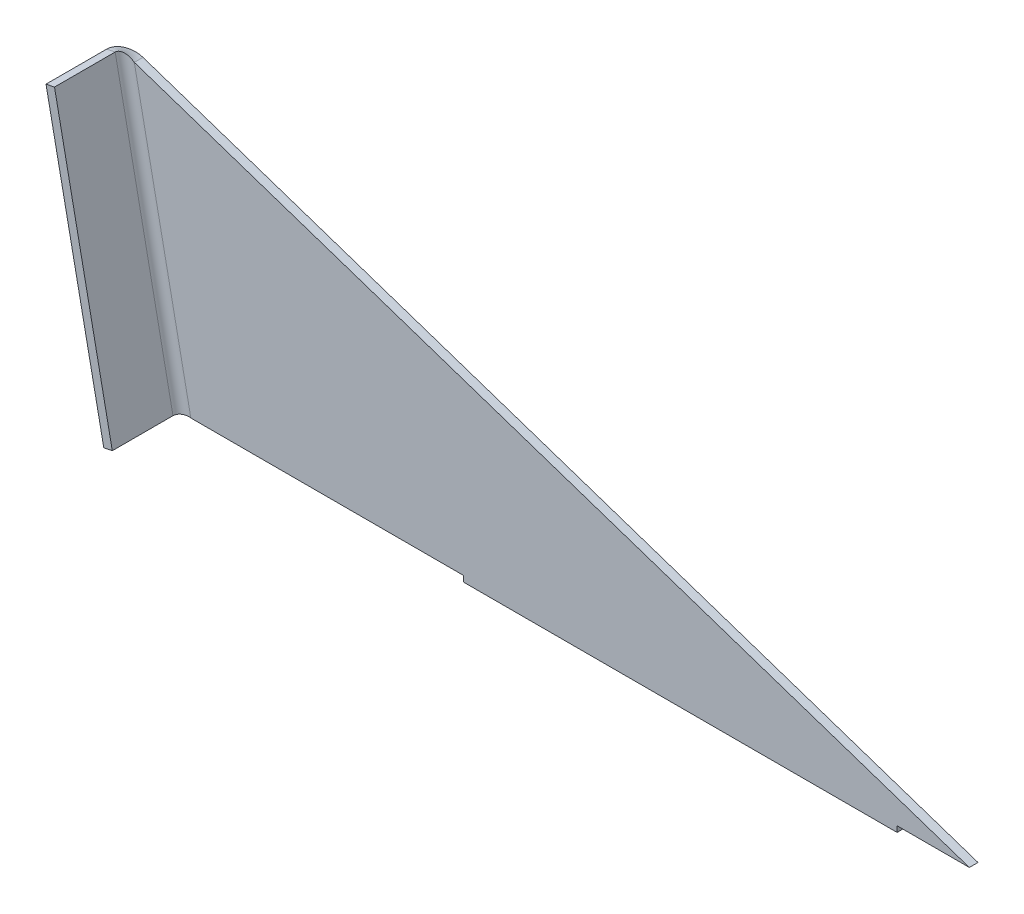
ISO-10303-21;
HEADER;
FILE_DESCRIPTION(('STEP AP214'),'2;1');
FILE_NAME('part.step','',(''),(''),'','','');
FILE_SCHEMA(('AUTOMOTIVE_DESIGN { 1 0 10303 214 1 1 1 1 }'));
ENDSEC;
DATA;
#1=APPLICATION_CONTEXT('core data for automotive mechanical design processes');
#2=APPLICATION_PROTOCOL_DEFINITION('international standard','automotive_design',2000,#1);
#3=PRODUCT_CONTEXT('',#1,'mechanical');
#4=PRODUCT('Part','Part','',(#3));
#5=PRODUCT_RELATED_PRODUCT_CATEGORY('part','',(#4));
#6=PRODUCT_DEFINITION_FORMATION('','',#4);
#7=PRODUCT_DEFINITION_CONTEXT('part definition',#1,'design');
#8=PRODUCT_DEFINITION('design','',#6,#7);
#9=PRODUCT_DEFINITION_SHAPE('','',#8);
#10=(LENGTH_UNIT() NAMED_UNIT(*) SI_UNIT(.MILLI.,.METRE.));
#11=(NAMED_UNIT(*) PLANE_ANGLE_UNIT() SI_UNIT($,.RADIAN.));
#12=(NAMED_UNIT(*) SI_UNIT($,.STERADIAN.) SOLID_ANGLE_UNIT());
#13=UNCERTAINTY_MEASURE_WITH_UNIT(LENGTH_MEASURE(1.E-05),#10,'distance_accuracy_value','');
#14=(GEOMETRIC_REPRESENTATION_CONTEXT(3) GLOBAL_UNCERTAINTY_ASSIGNED_CONTEXT((#13)) GLOBAL_UNIT_ASSIGNED_CONTEXT((#10,
#11,#12)) REPRESENTATION_CONTEXT('',''));
#15=CARTESIAN_POINT('',(0.,0.,0.));
#16=DIRECTION('',(0.,0.,1.));
#17=DIRECTION('',(1.,0.,0.));
#18=AXIS2_PLACEMENT_3D('',#15,#16,#17);
#19=CARTESIAN_POINT('',(20.,0.,2.));
#20=DIRECTION('',(0.198019801980198,-0.98019801980198,0.));
#21=DIRECTION('',(0.,0.,-1.));
#22=AXIS2_PLACEMENT_3D('',#19,#20,#21);
#23=PLANE('',#22);
#24=DIRECTION('',(-0.98019801980198,-0.198019801980198,0.));
#25=VECTOR('',#24,1.);
#26=CARTESIAN_POINT('',(20.,0.,6.));
#27=LINE('',#26,#25);
#28=CARTESIAN_POINT('',(22.940594059406,0.59405940594054,6.));
#29=VERTEX_POINT('',#28);
#30=CARTESIAN_POINT('',(20.,0.,6.));
#31=VERTEX_POINT('',#30);
#32=EDGE_CURVE('E11',#29,#31,#27,.T.);
#33=ORIENTED_EDGE('',*,*,#32,.F.);
#34=DIRECTION('',(0.,0.,1.));
#35=VECTOR('',#34,1.);
#36=CARTESIAN_POINT('',(22.940594059406,0.594059405940539,2.));
#37=LINE('',#36,#35);
#38=CARTESIAN_POINT('',(22.940594059406,0.594059405940539,27.));
#39=VERTEX_POINT('',#38);
#40=EDGE_CURVE('E96',#39,#29,#37,.F.);
#41=ORIENTED_EDGE('',*,*,#40,.F.);
#42=DIRECTION('',(-0.98019801980198,-0.198019801980198,0.));
#43=VECTOR('',#42,1.);
#44=CARTESIAN_POINT('',(20.,0.,27.));
#45=LINE('',#44,#43);
#46=CARTESIAN_POINT('',(20.,0.,27.));
#47=VERTEX_POINT('',#46);
#48=EDGE_CURVE('E47',#39,#47,#45,.T.);
#49=ORIENTED_EDGE('',*,*,#48,.T.);
#50=DIRECTION('',(0.,0.,-1.));
#51=VECTOR('',#50,1.);
#52=CARTESIAN_POINT('',(20.,0.,2.));
#53=LINE('',#52,#51);
#54=EDGE_CURVE('E99',#47,#31,#53,.T.);
#55=ORIENTED_EDGE('',*,*,#54,.T.);
#56=EDGE_LOOP('',(#33,#41,#49,#55));
#57=FACE_BOUND('',#56,.T.);
#58=ADVANCED_FACE('F35',(#57),#23,.T.);
#59=CARTESIAN_POINT('',(20.,0.,27.));
#60=DIRECTION('',(0.,0.,1.));
#61=DIRECTION('',(0.198019801980198,-0.98019801980198,0.));
#62=AXIS2_PLACEMENT_3D('',#59,#60,#61);
#63=PLANE('',#62);
#64=ORIENTED_EDGE('',*,*,#48,.F.);
#65=DIRECTION('',(-0.198019801980198,0.98019801980198,0.));
#66=VECTOR('',#65,1.);
#67=CARTESIAN_POINT('',(2.94059405940594,99.5940594059406,27.));
#68=LINE('',#67,#66);
#69=CARTESIAN_POINT('',(2.94059405940594,99.5940594059406,27.));
#70=VERTEX_POINT('',#69);
#71=EDGE_CURVE('E124',#70,#39,#68,.F.);
#72=ORIENTED_EDGE('',*,*,#71,.F.);
#73=DIRECTION('',(-0.98019801980198,-0.198019801980198,0.));
#74=VECTOR('',#73,1.);
#75=CARTESIAN_POINT('',(0.,99.,27.));
#76=LINE('',#75,#74);
#77=CARTESIAN_POINT('',(0.,99.,27.));
#78=VERTEX_POINT('',#77);
#79=EDGE_CURVE('E151',#70,#78,#76,.T.);
#80=ORIENTED_EDGE('',*,*,#79,.T.);
#81=DIRECTION('',(0.198019801980198,-0.98019801980198,0.));
#82=VECTOR('',#81,1.);
#83=CARTESIAN_POINT('',(20.,0.,27.));
#84=LINE('',#83,#82);
#85=EDGE_CURVE('E162',#78,#47,#84,.T.);
#86=ORIENTED_EDGE('',*,*,#85,.T.);
#87=EDGE_LOOP('',(#64,#72,#80,#86));
#88=FACE_BOUND('',#87,.T.);
#89=ADVANCED_FACE('F168',(#88),#63,.T.);
#90=CARTESIAN_POINT('',(0.,99.,2.));
#91=DIRECTION('',(0.198019801980198,-0.98019801980198,0.));
#92=DIRECTION('',(0.,0.,-1.));
#93=AXIS2_PLACEMENT_3D('',#90,#91,#92);
#94=PLANE('',#93);
#95=ORIENTED_EDGE('',*,*,#79,.F.);
#96=DIRECTION('',(0.,0.,1.));
#97=VECTOR('',#96,1.);
#98=CARTESIAN_POINT('',(2.94059405940594,99.5940594059406,2.));
#99=LINE('',#98,#97);
#100=CARTESIAN_POINT('',(2.94059405940594,99.5940594059406,6.));
#101=VERTEX_POINT('',#100);
#102=EDGE_CURVE('E214',#70,#101,#99,.F.);
#103=ORIENTED_EDGE('',*,*,#102,.T.);
#104=DIRECTION('',(-0.98019801980198,-0.198019801980198,0.));
#105=VECTOR('',#104,1.);
#106=CARTESIAN_POINT('',(0.,99.,6.));
#107=LINE('',#106,#105);
#108=CARTESIAN_POINT('',(0.,99.,6.));
#109=VERTEX_POINT('',#108);
#110=EDGE_CURVE('E148',#101,#109,#107,.T.);
#111=ORIENTED_EDGE('',*,*,#110,.T.);
#112=DIRECTION('',(0.,0.,-1.));
#113=VECTOR('',#112,1.);
#114=CARTESIAN_POINT('',(0.,99.,2.));
#115=LINE('',#114,#113);
#116=EDGE_CURVE('E169',#78,#109,#115,.T.);
#117=ORIENTED_EDGE('',*,*,#116,.F.);
#118=EDGE_LOOP('',(#95,#103,#111,#117));
#119=FACE_BOUND('',#118,.T.);
#120=ADVANCED_FACE('F218',(#119),#94,.F.);
#121=CARTESIAN_POINT('',(10.1905121939231,94.0069646400805,6.));
#122=CARTESIAN_POINT('',(11.1707102137251,94.2049844420607,6.));
#123=CARTESIAN_POINT('',(12.1509082335271,94.4030042440409,6.));
#124=CARTESIAN_POINT('',(13.1311062533291,94.6010240460211,6.));
#125=CARTESIAN_POINT('',(10.1905121939231,94.0069646400805,12.));
#126=CARTESIAN_POINT('',(11.1707102137251,94.2049844420607,14.));
#127=CARTESIAN_POINT('',(12.1509082335271,94.4030042440409,16.));
#128=CARTESIAN_POINT('',(13.1311062533291,94.6010240460211,18.));
#129=CARTESIAN_POINT('',(2.94059405940594,99.5940594059406,12.));
#130=CARTESIAN_POINT('',(1.96039603960396,99.3960396039604,14.));
#131=CARTESIAN_POINT('',(0.98019801980198,99.1980198019802,16.));
#132=CARTESIAN_POINT('',(0.,99.,18.));
#133=CARTESIAN_POINT('',(2.94059405940594,99.5940594059406,6.));
#134=CARTESIAN_POINT('',(1.96039603960396,99.3960396039604,6.));
#135=CARTESIAN_POINT('',(0.980198019801979,99.1980198019802,6.));
#136=CARTESIAN_POINT('',(0.,99.,6.));
#137=CARTESIAN_POINT('',(2.94059405940594,99.5940594059406,0.));
#138=CARTESIAN_POINT('',(1.96039603960396,99.3960396039604,-2.));
#139=CARTESIAN_POINT('',(0.980198019801978,99.1980198019802,-4.));
#140=CARTESIAN_POINT('',(0.,99.,-6.));
#141=CARTESIAN_POINT('',(10.1905121939231,94.0069646400805,0.));
#142=CARTESIAN_POINT('',(11.1707102137251,94.2049844420607,-2.));
#143=CARTESIAN_POINT('',(12.1509082335271,94.4030042440409,-4.));
#144=CARTESIAN_POINT('',(13.1311062533291,94.6010240460211,-6.));
#145=CARTESIAN_POINT('',(10.1905121939231,94.0069646400805,6.));
#146=CARTESIAN_POINT('',(11.1707102137251,94.2049844420607,6.));
#147=CARTESIAN_POINT('',(12.1509082335271,94.4030042440409,6.));
#148=CARTESIAN_POINT('',(13.1311062533291,94.6010240460211,6.));
#149=(BOUNDED_SURFACE() B_SPLINE_SURFACE(3,3,((#121,#122,#123,#124),(#125,#126,#127,#128),(#129,
#130,#131,#132),(#133,#134,#135,#136),(#137,#138,#139,#140),(#141,#142,#143,#144),(#145,#146,
#147,#148)),.UNSPECIFIED.,.T.,.F.,.F.) B_SPLINE_SURFACE_WITH_KNOTS((4,3,4),(4,4),(0.,0.5,1.),
(0.,1.),.UNSPECIFIED.) GEOMETRIC_REPRESENTATION_ITEM() RATIONAL_B_SPLINE_SURFACE(((1.,1.,1.,1.),
(0.333333333333333,0.333333333333333,0.333333333333333,0.333333333333333),(0.333333333333333,
0.333333333333333,0.333333333333333,0.333333333333333),(1.,1.,1.,1.),(0.333333333333333,
0.333333333333333,0.333333333333333,0.333333333333333),(0.333333333333333,0.333333333333333,
0.333333333333333,0.333333333333333),(1.,1.,1.,1.))) REPRESENTATION_ITEM('') SURFACE());
#150=CARTESIAN_POINT('',(6.56555312666453,96.8005120230106,6.));
#151=DIRECTION('',(-0.610413020357532,-0.792083293964716,0.));
#152=DIRECTION('',(0.792083293964716,-0.610413020357532,0.));
#153=AXIS2_PLACEMENT_3D('',#150,#151,#152);
#154=ELLIPSE('',#153,4.57648721400766,3.);
#155=CARTESIAN_POINT('',(6.56555312666459,96.8005120230105,3.));
#156=VERTEX_POINT('',#155);
#157=EDGE_CURVE('E114',#101,#156,#154,.T.);
#158=DIRECTION('',(0.,0.,-1.));
#159=VECTOR('',#158,1.);
#160=CARTESIAN_POINT('',(6.56555312666462,96.8005120230105,0.));
#161=LINE('',#160,#159);
#162=CARTESIAN_POINT('',(6.56555312666462,96.8005120230105,0.));
#163=VERTEX_POINT('',#162);
#164=EDGE_CURVE('E55',#156,#163,#161,.T.);
#165=CARTESIAN_POINT('',(6.56555312666453,96.8005120230106,6.));
#166=DIRECTION('',(-0.317653316973332,-0.948206923733338,0.));
#167=DIRECTION('',(0.948206923733338,-0.317653316973332,0.));
#168=AXIS2_PLACEMENT_3D('',#165,#166,#167);
#169=ELLIPSE('',#168,6.92417758437604,6.);
#170=EDGE_CURVE('E166',#109,#163,#169,.T.);
#171=ORIENTED_EDGE('',*,*,#110,.F.);
#172=ORIENTED_EDGE('',*,*,#157,.T.);
#173=ORIENTED_EDGE('',*,*,#164,.T.);
#174=ORIENTED_EDGE('',*,*,#170,.F.);
#175=EDGE_LOOP('',(#171,#172,#173,#174));
#176=FACE_BOUND('',#175,.T.);
#177=ADVANCED_FACE('F221',(#176),#149,.T.);
#178=CARTESIAN_POINT('',(295.518669044722,0.,0.));
#179=DIRECTION('',(0.317653316973332,0.948206923733338,0.));
#180=DIRECTION('',(-0.948206923733338,0.317653316973332,0.));
#181=AXIS2_PLACEMENT_3D('',#178,#179,#180);
#182=PLANE('',#181);
#183=ORIENTED_EDGE('',*,*,#164,.F.);
#184=DIRECTION('',(-0.948206923733338,0.317653316973332,0.));
#185=VECTOR('',#184,1.);
#186=CARTESIAN_POINT('',(295.518669044722,0.,3.));
#187=LINE('',#186,#185);
#188=CARTESIAN_POINT('',(295.518669044722,0.,3.));
#189=VERTEX_POINT('',#188);
#190=EDGE_CURVE('E119',#189,#156,#187,.T.);
#191=ORIENTED_EDGE('',*,*,#190,.F.);
#192=DIRECTION('',(0.,0.,-1.));
#193=VECTOR('',#192,1.);
#194=CARTESIAN_POINT('',(295.518669044722,0.,0.));
#195=LINE('',#194,#193);
#196=CARTESIAN_POINT('',(295.518669044722,0.,0.));
#197=VERTEX_POINT('',#196);
#198=EDGE_CURVE('E144',#189,#197,#195,.T.);
#199=ORIENTED_EDGE('',*,*,#198,.T.);
#200=DIRECTION('',(-0.948206923733338,0.317653316973332,0.));
#201=VECTOR('',#200,1.);
#202=CARTESIAN_POINT('',(295.518669044722,0.,0.));
#203=LINE('',#202,#201);
#204=EDGE_CURVE('E188',#197,#163,#203,.T.);
#205=ORIENTED_EDGE('',*,*,#204,.T.);
#206=EDGE_LOOP('',(#183,#191,#199,#205));
#207=FACE_BOUND('',#206,.T.);
#208=ADVANCED_FACE('F280',(#207),#182,.T.);
#209=CARTESIAN_POINT('',(270.518669044722,0.,0.));
#210=DIRECTION('',(0.,-1.,0.));
#211=DIRECTION('',(1.,0.,0.));
#212=AXIS2_PLACEMENT_3D('',#209,#210,#211);
#213=PLANE('',#212);
#214=ORIENTED_EDGE('',*,*,#198,.F.);
#215=DIRECTION('',(1.,0.,0.));
#216=VECTOR('',#215,1.);
#217=CARTESIAN_POINT('',(0.,0.,3.));
#218=LINE('',#217,#216);
#219=CARTESIAN_POINT('',(270.518669044722,0.,3.));
#220=VERTEX_POINT('',#219);
#221=EDGE_CURVE('E211',#220,#189,#218,.T.);
#222=ORIENTED_EDGE('',*,*,#221,.F.);
#223=DIRECTION('',(0.,0.,-1.));
#224=VECTOR('',#223,1.);
#225=CARTESIAN_POINT('',(270.518669044722,0.,0.));
#226=LINE('',#225,#224);
#227=CARTESIAN_POINT('',(270.518669044722,0.,0.));
#228=VERTEX_POINT('',#227);
#229=EDGE_CURVE('E141',#220,#228,#226,.T.);
#230=ORIENTED_EDGE('',*,*,#229,.T.);
#231=DIRECTION('',(1.,0.,0.));
#232=VECTOR('',#231,1.);
#233=CARTESIAN_POINT('',(270.518669044722,0.,0.));
#234=LINE('',#233,#232);
#235=EDGE_CURVE('E171',#228,#197,#234,.T.);
#236=ORIENTED_EDGE('',*,*,#235,.T.);
#237=EDGE_LOOP('',(#214,#222,#230,#236));
#238=FACE_BOUND('',#237,.T.);
#239=ADVANCED_FACE('F238',(#238),#213,.T.);
#240=CARTESIAN_POINT('',(270.518669044722,-2.,0.));
#241=DIRECTION('',(1.,0.,0.));
#242=DIRECTION('',(0.,1.,0.));
#243=AXIS2_PLACEMENT_3D('',#240,#241,#242);
#244=PLANE('',#243);
#245=ORIENTED_EDGE('',*,*,#229,.F.);
#246=DIRECTION('',(0.,1.,0.));
#247=VECTOR('',#246,1.);
#248=CARTESIAN_POINT('',(270.518669044722,0.,3.));
#249=LINE('',#248,#247);
#250=CARTESIAN_POINT('',(270.518669044722,-2.,3.));
#251=VERTEX_POINT('',#250);
#252=EDGE_CURVE('E208',#251,#220,#249,.T.);
#253=ORIENTED_EDGE('',*,*,#252,.F.);
#254=DIRECTION('',(0.,0.,-1.));
#255=VECTOR('',#254,1.);
#256=CARTESIAN_POINT('',(270.518669044722,-2.,0.));
#257=LINE('',#256,#255);
#258=CARTESIAN_POINT('',(270.518669044722,-2.,0.));
#259=VERTEX_POINT('',#258);
#260=EDGE_CURVE('E138',#251,#259,#257,.T.);
#261=ORIENTED_EDGE('',*,*,#260,.T.);
#262=DIRECTION('',(0.,1.,0.));
#263=VECTOR('',#262,1.);
#264=CARTESIAN_POINT('',(270.518669044722,-2.,0.));
#265=LINE('',#264,#263);
#266=EDGE_CURVE('E176',#259,#228,#265,.T.);
#267=ORIENTED_EDGE('',*,*,#266,.T.);
#268=EDGE_LOOP('',(#245,#253,#261,#267));
#269=FACE_BOUND('',#268,.T.);
#270=ADVANCED_FACE('F247',(#269),#244,.T.);
#271=CARTESIAN_POINT('',(120.518669044722,-2.,0.));
#272=DIRECTION('',(0.,-1.,0.));
#273=DIRECTION('',(1.,0.,0.));
#274=AXIS2_PLACEMENT_3D('',#271,#272,#273);
#275=PLANE('',#274);
#276=ORIENTED_EDGE('',*,*,#260,.F.);
#277=DIRECTION('',(1.,0.,0.));
#278=VECTOR('',#277,1.);
#279=CARTESIAN_POINT('',(0.,-2.,3.));
#280=LINE('',#279,#278);
#281=CARTESIAN_POINT('',(120.518669044722,-2.,3.));
#282=VERTEX_POINT('',#281);
#283=EDGE_CURVE('E205',#282,#251,#280,.T.);
#284=ORIENTED_EDGE('',*,*,#283,.F.);
#285=DIRECTION('',(0.,0.,-1.));
#286=VECTOR('',#285,1.);
#287=CARTESIAN_POINT('',(120.518669044722,-2.,0.));
#288=LINE('',#287,#286);
#289=CARTESIAN_POINT('',(120.518669044722,-2.,0.));
#290=VERTEX_POINT('',#289);
#291=EDGE_CURVE('E135',#282,#290,#288,.T.);
#292=ORIENTED_EDGE('',*,*,#291,.T.);
#293=DIRECTION('',(1.,0.,0.));
#294=VECTOR('',#293,1.);
#295=CARTESIAN_POINT('',(120.518669044722,-2.,0.));
#296=LINE('',#295,#294);
#297=EDGE_CURVE('E179',#290,#259,#296,.T.);
#298=ORIENTED_EDGE('',*,*,#297,.T.);
#299=EDGE_LOOP('',(#276,#284,#292,#298));
#300=FACE_BOUND('',#299,.T.);
#301=ADVANCED_FACE('F250',(#300),#275,.T.);
#302=CARTESIAN_POINT('',(120.518669044722,-2.,0.));
#303=DIRECTION('',(-1.,0.,0.));
#304=DIRECTION('',(0.,-1.,0.));
#305=AXIS2_PLACEMENT_3D('',#302,#303,#304);
#306=PLANE('',#305);
#307=ORIENTED_EDGE('',*,*,#291,.F.);
#308=DIRECTION('',(0.,1.,0.));
#309=VECTOR('',#308,1.);
#310=CARTESIAN_POINT('',(120.518669044722,0.,3.));
#311=LINE('',#310,#309);
#312=CARTESIAN_POINT('',(120.518669044722,0.,3.));
#313=VERTEX_POINT('',#312);
#314=EDGE_CURVE('E202',#313,#282,#311,.F.);
#315=ORIENTED_EDGE('',*,*,#314,.F.);
#316=DIRECTION('',(0.,0.,-1.));
#317=VECTOR('',#316,1.);
#318=CARTESIAN_POINT('',(120.518669044722,0.,0.));
#319=LINE('',#318,#317);
#320=CARTESIAN_POINT('',(120.518669044722,0.,0.));
#321=VERTEX_POINT('',#320);
#322=EDGE_CURVE('E132',#313,#321,#319,.T.);
#323=ORIENTED_EDGE('',*,*,#322,.T.);
#324=DIRECTION('',(0.,-1.,0.));
#325=VECTOR('',#324,1.);
#326=CARTESIAN_POINT('',(120.518669044722,-2.,0.));
#327=LINE('',#326,#325);
#328=EDGE_CURVE('E182',#321,#290,#327,.T.);
#329=ORIENTED_EDGE('',*,*,#328,.T.);
#330=EDGE_LOOP('',(#307,#315,#323,#329));
#331=FACE_BOUND('',#330,.T.);
#332=ADVANCED_FACE('F255',(#331),#306,.T.);
#333=CARTESIAN_POINT('',(20.,0.,0.));
#334=DIRECTION('',(0.,-1.,0.));
#335=DIRECTION('',(1.,0.,0.));
#336=AXIS2_PLACEMENT_3D('',#333,#334,#335);
#337=PLANE('',#336);
#338=ORIENTED_EDGE('',*,*,#322,.F.);
#339=DIRECTION('',(1.,0.,0.));
#340=VECTOR('',#339,1.);
#341=CARTESIAN_POINT('',(0.,0.,3.));
#342=LINE('',#341,#340);
#343=CARTESIAN_POINT('',(26.1212121212121,0.,3.));
#344=VERTEX_POINT('',#343);
#345=EDGE_CURVE('E199',#344,#313,#342,.T.);
#346=ORIENTED_EDGE('',*,*,#345,.F.);
#347=DIRECTION('',(0.,0.,-1.));
#348=VECTOR('',#347,1.);
#349=CARTESIAN_POINT('',(26.1212121212121,0.,0.));
#350=LINE('',#349,#348);
#351=CARTESIAN_POINT('',(26.1212121212121,0.,0.));
#352=VERTEX_POINT('',#351);
#353=EDGE_CURVE('E41',#344,#352,#350,.T.);
#354=ORIENTED_EDGE('',*,*,#353,.T.);
#355=DIRECTION('',(1.,0.,0.));
#356=VECTOR('',#355,1.);
#357=CARTESIAN_POINT('',(20.,0.,0.));
#358=LINE('',#357,#356);
#359=EDGE_CURVE('E185',#352,#321,#358,.T.);
#360=ORIENTED_EDGE('',*,*,#359,.T.);
#361=EDGE_LOOP('',(#338,#346,#354,#360));
#362=FACE_BOUND('',#361,.T.);
#363=ADVANCED_FACE('F258',(#362),#337,.T.);
#364=CARTESIAN_POINT('',(32.2424242424243,0.,6.));
#365=CARTESIAN_POINT('',(31.2622262226223,-0.198019801980197,6.));
#366=CARTESIAN_POINT('',(30.2820282028203,-0.396039603960394,6.));
#367=CARTESIAN_POINT('',(29.3018301830183,-0.594059405940591,6.));
#368=CARTESIAN_POINT('',(32.2424242424243,0.,-6.));
#369=CARTESIAN_POINT('',(31.2622262226223,-0.198019801980197,-4.));
#370=CARTESIAN_POINT('',(30.2820282028203,-0.396039603960394,-2.));
#371=CARTESIAN_POINT('',(29.3018301830183,-0.594059405940591,0.));
#372=CARTESIAN_POINT('',(20.,0.,-6.));
#373=CARTESIAN_POINT('',(20.980198019802,0.198019801980197,-4.));
#374=CARTESIAN_POINT('',(21.960396039604,0.396039603960394,-2.));
#375=CARTESIAN_POINT('',(22.9405940594059,0.594059405940591,0.));
#376=CARTESIAN_POINT('',(20.,0.,6.));
#377=CARTESIAN_POINT('',(20.980198019802,0.198019801980197,6.));
#378=CARTESIAN_POINT('',(21.960396039604,0.396039603960394,6.));
#379=CARTESIAN_POINT('',(22.9405940594059,0.594059405940591,6.));
#380=CARTESIAN_POINT('',(20.,0.,18.));
#381=CARTESIAN_POINT('',(20.980198019802,0.198019801980197,16.));
#382=CARTESIAN_POINT('',(21.960396039604,0.396039603960394,14.));
#383=CARTESIAN_POINT('',(22.9405940594059,0.594059405940591,12.));
#384=CARTESIAN_POINT('',(32.2424242424243,0.,18.));
#385=CARTESIAN_POINT('',(31.2622262226223,-0.198019801980197,16.));
#386=CARTESIAN_POINT('',(30.2820282028203,-0.396039603960394,14.));
#387=CARTESIAN_POINT('',(29.3018301830183,-0.594059405940591,12.));
#388=CARTESIAN_POINT('',(32.2424242424243,0.,6.));
#389=CARTESIAN_POINT('',(31.2622262226223,-0.198019801980197,6.));
#390=CARTESIAN_POINT('',(30.2820282028203,-0.396039603960394,6.));
#391=CARTESIAN_POINT('',(29.3018301830183,-0.594059405940591,6.));
#392=(BOUNDED_SURFACE() B_SPLINE_SURFACE(3,3,((#364,#365,#366,#367),(#368,#369,#370,#371),(#372,
#373,#374,#375),(#376,#377,#378,#379),(#380,#381,#382,#383),(#384,#385,#386,#387),(#388,#389,
#390,#391)),.UNSPECIFIED.,.T.,.F.,.F.) B_SPLINE_SURFACE_WITH_KNOTS((4,3,4),(4,4),(0.,0.5,1.),
(0.,1.),.UNSPECIFIED.) GEOMETRIC_REPRESENTATION_ITEM() RATIONAL_B_SPLINE_SURFACE(((1.,1.,1.,1.),
(0.333333333333333,0.333333333333333,0.333333333333333,0.333333333333333),(0.333333333333333,
0.333333333333333,0.333333333333333,0.333333333333333),(1.,1.,1.,1.),(0.333333333333333,
0.333333333333333,0.333333333333333,0.333333333333333),(0.333333333333333,0.333333333333333,
0.333333333333333,0.333333333333333),(1.,1.,1.,1.))) REPRESENTATION_ITEM('') SURFACE());
#393=CARTESIAN_POINT('',(26.1212121212121,0.,6.));
#394=DIRECTION('',(-0.183599859128585,-0.983001063950576,0.));
#395=DIRECTION('',(0.983001063950576,-0.183599859128585,0.));
#396=AXIS2_PLACEMENT_3D('',#393,#394,#395);
#397=ELLIPSE('',#396,3.2356201620206,3.);
#398=EDGE_CURVE('E112',#344,#29,#397,.F.);
#399=CARTESIAN_POINT('',(26.1212121212121,0.,6.));
#400=DIRECTION('',(0.,-1.,0.));
#401=DIRECTION('',(1.,0.,0.));
#402=AXIS2_PLACEMENT_3D('',#399,#400,#401);
#403=ELLIPSE('',#402,6.12121212121212,6.);
#404=EDGE_CURVE('E195',#352,#31,#403,.F.);
#405=ORIENTED_EDGE('',*,*,#398,.T.);
#406=ORIENTED_EDGE('',*,*,#32,.T.);
#407=ORIENTED_EDGE('',*,*,#404,.F.);
#408=ORIENTED_EDGE('',*,*,#353,.F.);
#409=EDGE_LOOP('',(#405,#406,#407,#408));
#410=FACE_BOUND('',#409,.T.);
#411=ADVANCED_FACE('F37',(#410),#392,.F.);
#412=CARTESIAN_POINT('',(0.,0.,0.));
#413=DIRECTION('',(0.,0.,1.));
#414=DIRECTION('',(1.,0.,0.));
#415=AXIS2_PLACEMENT_3D('',#412,#413,#414);
#416=PLANE('',#415);
#417=ORIENTED_EDGE('',*,*,#359,.F.);
#418=DIRECTION('',(0.198019801980198,-0.98019801980198,0.));
#419=VECTOR('',#418,1.);
#420=CARTESIAN_POINT('',(25.0969512792863,5.0700911675326,0.));
#421=LINE('',#420,#419);
#422=EDGE_CURVE('E192',#352,#163,#421,.F.);
#423=ORIENTED_EDGE('',*,*,#422,.T.);
#424=ORIENTED_EDGE('',*,*,#204,.F.);
#425=ORIENTED_EDGE('',*,*,#235,.F.);
#426=ORIENTED_EDGE('',*,*,#266,.F.);
#427=ORIENTED_EDGE('',*,*,#297,.F.);
#428=ORIENTED_EDGE('',*,*,#328,.F.);
#429=EDGE_LOOP('',(#417,#423,#424,#425,#426,#427,#428));
#430=FACE_BOUND('',#429,.T.);
#431=ADVANCED_FACE('F245',(#430),#416,.F.);
#432=CARTESIAN_POINT('',(0.,99.,2.));
#433=DIRECTION('',(0.98019801980198,0.198019801980198,0.));
#434=DIRECTION('',(-0.198019801980198,0.98019801980198,0.));
#435=AXIS2_PLACEMENT_3D('',#432,#433,#434);
#436=PLANE('',#435);
#437=ORIENTED_EDGE('',*,*,#116,.T.);
#438=DIRECTION('',(0.198019801980198,-0.98019801980198,0.));
#439=VECTOR('',#438,1.);
#440=CARTESIAN_POINT('',(0.,99.,6.));
#441=LINE('',#440,#439);
#442=EDGE_CURVE('E165',#109,#31,#441,.T.);
#443=ORIENTED_EDGE('',*,*,#442,.T.);
#444=ORIENTED_EDGE('',*,*,#54,.F.);
#445=ORIENTED_EDGE('',*,*,#85,.F.);
#446=EDGE_LOOP('',(#437,#443,#444,#445));
#447=FACE_BOUND('',#446,.T.);
#448=ADVANCED_FACE('F161',(#447),#436,.F.);
#449=CARTESIAN_POINT('',(5.88118811881188,100.188118811881,6.));
#450=DIRECTION('',(0.198019801980198,-0.98019801980198,0.));
#451=DIRECTION('',(0.98019801980198,0.198019801980198,0.));
#452=AXIS2_PLACEMENT_3D('',#449,#450,#451);
#453=CYLINDRICAL_SURFACE('',#452,6.);
#454=ORIENTED_EDGE('',*,*,#170,.T.);
#455=ORIENTED_EDGE('',*,*,#422,.F.);
#456=ORIENTED_EDGE('',*,*,#404,.T.);
#457=ORIENTED_EDGE('',*,*,#442,.F.);
#458=EDGE_LOOP('',(#454,#455,#456,#457));
#459=FACE_BOUND('',#458,.T.);
#460=ADVANCED_FACE('F224',(#459),#453,.T.);
#461=CARTESIAN_POINT('',(0.,0.,3.));
#462=DIRECTION('',(0.,0.,1.));
#463=DIRECTION('',(1.,0.,0.));
#464=AXIS2_PLACEMENT_3D('',#461,#462,#463);
#465=PLANE('',#464);
#466=ORIENTED_EDGE('',*,*,#345,.T.);
#467=ORIENTED_EDGE('',*,*,#314,.T.);
#468=ORIENTED_EDGE('',*,*,#283,.T.);
#469=ORIENTED_EDGE('',*,*,#252,.T.);
#470=ORIENTED_EDGE('',*,*,#221,.T.);
#471=ORIENTED_EDGE('',*,*,#190,.T.);
#472=DIRECTION('',(0.198019801980198,-0.98019801980198,0.));
#473=VECTOR('',#472,1.);
#474=CARTESIAN_POINT('',(5.88118811881188,100.188118811881,3.));
#475=LINE('',#474,#473);
#476=EDGE_CURVE('E118',#344,#156,#475,.F.);
#477=ORIENTED_EDGE('',*,*,#476,.F.);
#478=EDGE_LOOP('',(#466,#467,#468,#469,#470,#471,#477));
#479=FACE_BOUND('',#478,.T.);
#480=ADVANCED_FACE('F252',(#479),#465,.T.);
#481=CARTESIAN_POINT('',(2.94059405940594,99.5940594059406,2.));
#482=DIRECTION('',(0.98019801980198,0.198019801980198,0.));
#483=DIRECTION('',(-0.198019801980198,0.98019801980198,0.));
#484=AXIS2_PLACEMENT_3D('',#481,#482,#483);
#485=PLANE('',#484);
#486=ORIENTED_EDGE('',*,*,#102,.F.);
#487=ORIENTED_EDGE('',*,*,#71,.T.);
#488=ORIENTED_EDGE('',*,*,#40,.T.);
#489=DIRECTION('',(-0.198019801980198,0.98019801980198,0.));
#490=VECTOR('',#489,1.);
#491=CARTESIAN_POINT('',(2.94059405940594,99.5940594059406,6.));
#492=LINE('',#491,#490);
#493=EDGE_CURVE('E109',#101,#29,#492,.F.);
#494=ORIENTED_EDGE('',*,*,#493,.F.);
#495=EDGE_LOOP('',(#486,#487,#488,#494));
#496=FACE_BOUND('',#495,.T.);
#497=ADVANCED_FACE('F122',(#496),#485,.T.);
#498=CARTESIAN_POINT('',(5.88118811881188,100.188118811881,6.));
#499=DIRECTION('',(0.198019801980198,-0.98019801980198,0.));
#500=DIRECTION('',(0.98019801980198,0.198019801980198,0.));
#501=AXIS2_PLACEMENT_3D('',#498,#499,#500);
#502=CYLINDRICAL_SURFACE('',#501,3.);
#503=ORIENTED_EDGE('',*,*,#157,.F.);
#504=ORIENTED_EDGE('',*,*,#493,.T.);
#505=ORIENTED_EDGE('',*,*,#398,.F.);
#506=ORIENTED_EDGE('',*,*,#476,.T.);
#507=EDGE_LOOP('',(#503,#504,#505,#506));
#508=FACE_BOUND('',#507,.T.);
#509=ADVANCED_FACE('F110',(#508),#502,.F.);
#510=CLOSED_SHELL('',(#58,#89,#120,#177,#208,#239,#270,#301,#332,#363,#411,#431,#448,#460,#480,
#497,#509));
#511=MANIFOLD_SOLID_BREP('B2',#510);
#512=ADVANCED_BREP_SHAPE_REPRESENTATION('',(#18,#511),#14);
#513=SHAPE_DEFINITION_REPRESENTATION(#9,#512);
ENDSEC;
END-ISO-10303-21;
